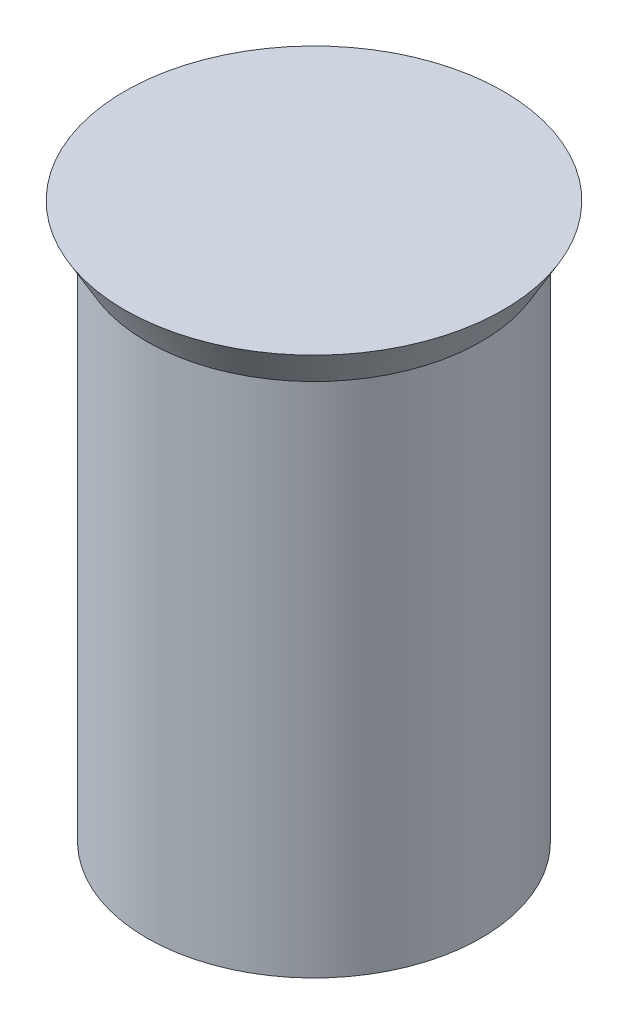
ISO-10303-21;
HEADER;
FILE_DESCRIPTION(('STEP AP214'),'2;1');
FILE_NAME('part.step','',(''),(''),'','','');
FILE_SCHEMA(('AUTOMOTIVE_DESIGN { 1 0 10303 214 1 1 1 1 }'));
ENDSEC;
DATA;
#1=APPLICATION_CONTEXT('core data for automotive mechanical design processes');
#2=APPLICATION_PROTOCOL_DEFINITION('international standard','automotive_design',2000,#1);
#3=PRODUCT_CONTEXT('',#1,'mechanical');
#4=PRODUCT('Part','Part','',(#3));
#5=PRODUCT_RELATED_PRODUCT_CATEGORY('part','',(#4));
#6=PRODUCT_DEFINITION_FORMATION('','',#4);
#7=PRODUCT_DEFINITION_CONTEXT('part definition',#1,'design');
#8=PRODUCT_DEFINITION('design','',#6,#7);
#9=PRODUCT_DEFINITION_SHAPE('','',#8);
#10=(LENGTH_UNIT() NAMED_UNIT(*) SI_UNIT(.MILLI.,.METRE.));
#11=(NAMED_UNIT(*) PLANE_ANGLE_UNIT() SI_UNIT($,.RADIAN.));
#12=(NAMED_UNIT(*) SI_UNIT($,.STERADIAN.) SOLID_ANGLE_UNIT());
#13=UNCERTAINTY_MEASURE_WITH_UNIT(LENGTH_MEASURE(1.E-05),#10,'distance_accuracy_value','');
#14=(GEOMETRIC_REPRESENTATION_CONTEXT(3) GLOBAL_UNCERTAINTY_ASSIGNED_CONTEXT((#13)) GLOBAL_UNIT_ASSIGNED_CONTEXT((#10,
#11,#12)) REPRESENTATION_CONTEXT('',''));
#15=CARTESIAN_POINT('',(0.,0.,0.));
#16=DIRECTION('',(0.,0.,1.));
#17=DIRECTION('',(1.,0.,0.));
#18=AXIS2_PLACEMENT_3D('',#15,#16,#17);
#19=CARTESIAN_POINT('',(0.,0.,0.));
#20=DIRECTION('',(0.,-1.,0.));
#21=DIRECTION('',(0.,0.,-1.));
#22=AXIS2_PLACEMENT_3D('',#19,#20,#21);
#23=PLANE('',#22);
#24=CARTESIAN_POINT('',(0.,0.,0.));
#25=DIRECTION('',(0.,1.,0.));
#26=DIRECTION('',(0.,0.,1.));
#27=AXIS2_PLACEMENT_3D('',#24,#25,#26);
#28=CIRCLE('',#27,1.625);
#29=CARTESIAN_POINT('',(0.,0.,1.625));
#30=VERTEX_POINT('',#29);
#31=EDGE_CURVE('E10',#30,#30,#28,.T.);
#32=ORIENTED_EDGE('',*,*,#31,.T.);
#33=EDGE_LOOP('',(#32));
#34=FACE_BOUND('',#33,.T.);
#35=ADVANCED_FACE('F36',(#34),#23,.F.);
#36=CARTESIAN_POINT('',(0.,-0.3302,0.));
#37=DIRECTION('',(0.,1.,0.));
#38=DIRECTION('',(0.,0.,1.));
#39=AXIS2_PLACEMENT_3D('',#36,#37,#38);
#40=CONICAL_SURFACE('',#39,1.435,0.522141481989295);
#41=ORIENTED_EDGE('',*,*,#31,.F.);
#42=EDGE_LOOP('',(#41));
#43=FACE_BOUND('',#42,.T.);
#44=CARTESIAN_POINT('',(0.,-0.3302,0.));
#45=DIRECTION('',(0.,1.,0.));
#46=DIRECTION('',(0.,0.,1.));
#47=AXIS2_PLACEMENT_3D('',#44,#45,#46);
#48=CIRCLE('',#47,1.435);
#49=CARTESIAN_POINT('',(0.,-0.3302,1.435));
#50=VERTEX_POINT('',#49);
#51=EDGE_CURVE('E42',#50,#50,#48,.T.);
#52=ORIENTED_EDGE('',*,*,#51,.T.);
#53=EDGE_LOOP('',(#52));
#54=FACE_BOUND('',#53,.T.);
#55=ADVANCED_FACE('F61',(#43,#54),#40,.T.);
#56=CARTESIAN_POINT('',(0.,0.,0.));
#57=DIRECTION('',(0.,1.,0.));
#58=DIRECTION('',(0.,0.,1.));
#59=AXIS2_PLACEMENT_3D('',#56,#57,#58);
#60=CYLINDRICAL_SURFACE('',#59,1.435);
#61=ORIENTED_EDGE('',*,*,#51,.F.);
#62=EDGE_LOOP('',(#61));
#63=FACE_BOUND('',#62,.T.);
#64=CARTESIAN_POINT('',(0.,-4.7625,0.));
#65=DIRECTION('',(0.,1.,0.));
#66=DIRECTION('',(0.,0.,1.));
#67=AXIS2_PLACEMENT_3D('',#64,#65,#66);
#68=CIRCLE('',#67,1.435);
#69=CARTESIAN_POINT('',(0.,-4.7625,1.435));
#70=VERTEX_POINT('',#69);
#71=EDGE_CURVE('E46',#70,#70,#68,.T.);
#72=ORIENTED_EDGE('',*,*,#71,.T.);
#73=EDGE_LOOP('',(#72));
#74=FACE_BOUND('',#73,.T.);
#75=ADVANCED_FACE('F53',(#63,#74),#60,.T.);
#76=CARTESIAN_POINT('',(0.,-4.7625,-1.435));
#77=DIRECTION('',(0.,1.,0.));
#78=DIRECTION('',(0.,0.,1.));
#79=AXIS2_PLACEMENT_3D('',#76,#77,#78);
#80=PLANE('',#79);
#81=ORIENTED_EDGE('',*,*,#71,.F.);
#82=EDGE_LOOP('',(#81));
#83=FACE_BOUND('',#82,.T.);
#84=ADVANCED_FACE('F55',(#83),#80,.F.);
#85=CLOSED_SHELL('',(#35,#55,#75,#84));
#86=MANIFOLD_SOLID_BREP('B2',#85);
#87=ADVANCED_BREP_SHAPE_REPRESENTATION('',(#18,#86),#14);
#88=SHAPE_DEFINITION_REPRESENTATION(#9,#87);
ENDSEC;
END-ISO-10303-21;
